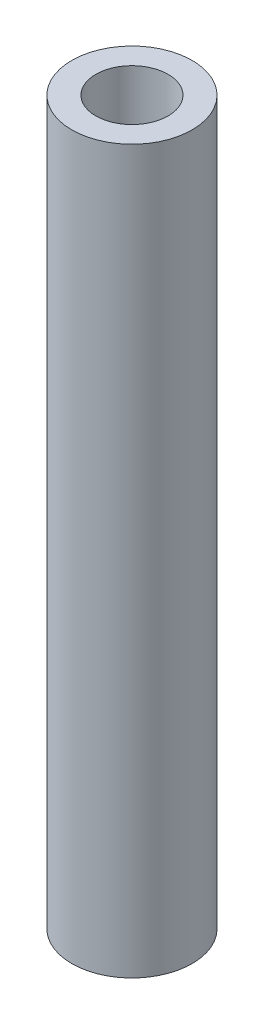
ISO-10303-21;
HEADER;
FILE_DESCRIPTION(('STEP AP214'),'2;1');
FILE_NAME('part.step','',(''),(''),'','','');
FILE_SCHEMA(('AUTOMOTIVE_DESIGN { 1 0 10303 214 1 1 1 1 }'));
ENDSEC;
DATA;
#1=APPLICATION_CONTEXT('core data for automotive mechanical design processes');
#2=APPLICATION_PROTOCOL_DEFINITION('international standard','automotive_design',2000,#1);
#3=PRODUCT_CONTEXT('',#1,'mechanical');
#4=PRODUCT('Part','Part','',(#3));
#5=PRODUCT_RELATED_PRODUCT_CATEGORY('part','',(#4));
#6=PRODUCT_DEFINITION_FORMATION('','',#4);
#7=PRODUCT_DEFINITION_CONTEXT('part definition',#1,'design');
#8=PRODUCT_DEFINITION('design','',#6,#7);
#9=PRODUCT_DEFINITION_SHAPE('','',#8);
#10=(LENGTH_UNIT() NAMED_UNIT(*) SI_UNIT(.MILLI.,.METRE.));
#11=(NAMED_UNIT(*) PLANE_ANGLE_UNIT() SI_UNIT($,.RADIAN.));
#12=(NAMED_UNIT(*) SI_UNIT($,.STERADIAN.) SOLID_ANGLE_UNIT());
#13=UNCERTAINTY_MEASURE_WITH_UNIT(LENGTH_MEASURE(1.E-05),#10,'distance_accuracy_value','');
#14=(GEOMETRIC_REPRESENTATION_CONTEXT(3) GLOBAL_UNCERTAINTY_ASSIGNED_CONTEXT((#13)) GLOBAL_UNIT_ASSIGNED_CONTEXT((#10,
#11,#12)) REPRESENTATION_CONTEXT('',''));
#15=CARTESIAN_POINT('',(0.,0.,0.));
#16=DIRECTION('',(0.,0.,1.));
#17=DIRECTION('',(1.,0.,0.));
#18=AXIS2_PLACEMENT_3D('',#15,#16,#17);
#19=CARTESIAN_POINT('',(0.,30.,0.));
#20=DIRECTION('',(0.,1.,0.));
#21=DIRECTION('',(0.,0.,1.));
#22=AXIS2_PLACEMENT_3D('',#19,#20,#21);
#23=PLANE('',#22);
#24=CARTESIAN_POINT('',(0.,30.,0.));
#25=DIRECTION('',(0.,1.,0.));
#26=DIRECTION('',(0.,0.,1.));
#27=AXIS2_PLACEMENT_3D('',#24,#25,#26);
#28=CIRCLE('',#27,2.5);
#29=CARTESIAN_POINT('',(0.,30.,2.5));
#30=VERTEX_POINT('',#29);
#31=EDGE_CURVE('E10',#30,#30,#28,.T.);
#32=ORIENTED_EDGE('',*,*,#31,.T.);
#33=EDGE_LOOP('',(#32));
#34=FACE_BOUND('',#33,.T.);
#35=CARTESIAN_POINT('',(0.,30.,0.));
#36=DIRECTION('',(0.,1.,0.));
#37=DIRECTION('',(0.,0.,1.));
#38=AXIS2_PLACEMENT_3D('',#35,#36,#37);
#39=CIRCLE('',#38,1.5);
#40=CARTESIAN_POINT('',(0.,30.,1.5));
#41=VERTEX_POINT('',#40);
#42=EDGE_CURVE('E45',#41,#41,#39,.T.);
#43=ORIENTED_EDGE('',*,*,#42,.F.);
#44=EDGE_LOOP('',(#43));
#45=FACE_BOUND('',#44,.T.);
#46=ADVANCED_FACE('F34',(#34,#45),#23,.T.);
#47=CARTESIAN_POINT('',(0.,0.,0.));
#48=DIRECTION('',(0.,1.,0.));
#49=DIRECTION('',(0.,0.,1.));
#50=AXIS2_PLACEMENT_3D('',#47,#48,#49);
#51=PLANE('',#50);
#52=CARTESIAN_POINT('',(0.,0.,0.));
#53=DIRECTION('',(0.,1.,0.));
#54=DIRECTION('',(0.,0.,1.));
#55=AXIS2_PLACEMENT_3D('',#52,#53,#54);
#56=CIRCLE('',#55,2.5);
#57=CARTESIAN_POINT('',(0.,0.,2.5));
#58=VERTEX_POINT('',#57);
#59=EDGE_CURVE('E38',#58,#58,#56,.T.);
#60=ORIENTED_EDGE('',*,*,#59,.F.);
#61=EDGE_LOOP('',(#60));
#62=FACE_BOUND('',#61,.T.);
#63=CARTESIAN_POINT('',(0.,0.,0.));
#64=DIRECTION('',(0.,1.,0.));
#65=DIRECTION('',(0.,0.,1.));
#66=AXIS2_PLACEMENT_3D('',#63,#64,#65);
#67=CIRCLE('',#66,1.5);
#68=CARTESIAN_POINT('',(0.,0.,1.5));
#69=VERTEX_POINT('',#68);
#70=EDGE_CURVE('E47',#69,#69,#67,.T.);
#71=ORIENTED_EDGE('',*,*,#70,.T.);
#72=EDGE_LOOP('',(#71));
#73=FACE_BOUND('',#72,.T.);
#74=ADVANCED_FACE('F57',(#62,#73),#51,.F.);
#75=CARTESIAN_POINT('',(0.,30.,0.));
#76=DIRECTION('',(0.,-1.,0.));
#77=DIRECTION('',(0.,0.,-1.));
#78=AXIS2_PLACEMENT_3D('',#75,#76,#77);
#79=CYLINDRICAL_SURFACE('',#78,2.5);
#80=ORIENTED_EDGE('',*,*,#31,.F.);
#81=EDGE_LOOP('',(#80));
#82=FACE_BOUND('',#81,.T.);
#83=ORIENTED_EDGE('',*,*,#59,.T.);
#84=EDGE_LOOP('',(#83));
#85=FACE_BOUND('',#84,.T.);
#86=ADVANCED_FACE('F36',(#82,#85),#79,.T.);
#87=CARTESIAN_POINT('',(0.,30.,0.));
#88=DIRECTION('',(0.,-1.,0.));
#89=DIRECTION('',(0.,0.,-1.));
#90=AXIS2_PLACEMENT_3D('',#87,#88,#89);
#91=CYLINDRICAL_SURFACE('',#90,1.5);
#92=ORIENTED_EDGE('',*,*,#42,.T.);
#93=EDGE_LOOP('',(#92));
#94=FACE_BOUND('',#93,.T.);
#95=ORIENTED_EDGE('',*,*,#70,.F.);
#96=EDGE_LOOP('',(#95));
#97=FACE_BOUND('',#96,.T.);
#98=ADVANCED_FACE('F53',(#94,#97),#91,.F.);
#99=CLOSED_SHELL('',(#46,#74,#86,#98));
#100=MANIFOLD_SOLID_BREP('B2',#99);
#101=ADVANCED_BREP_SHAPE_REPRESENTATION('',(#18,#100),#14);
#102=SHAPE_DEFINITION_REPRESENTATION(#9,#101);
ENDSEC;
END-ISO-10303-21;
